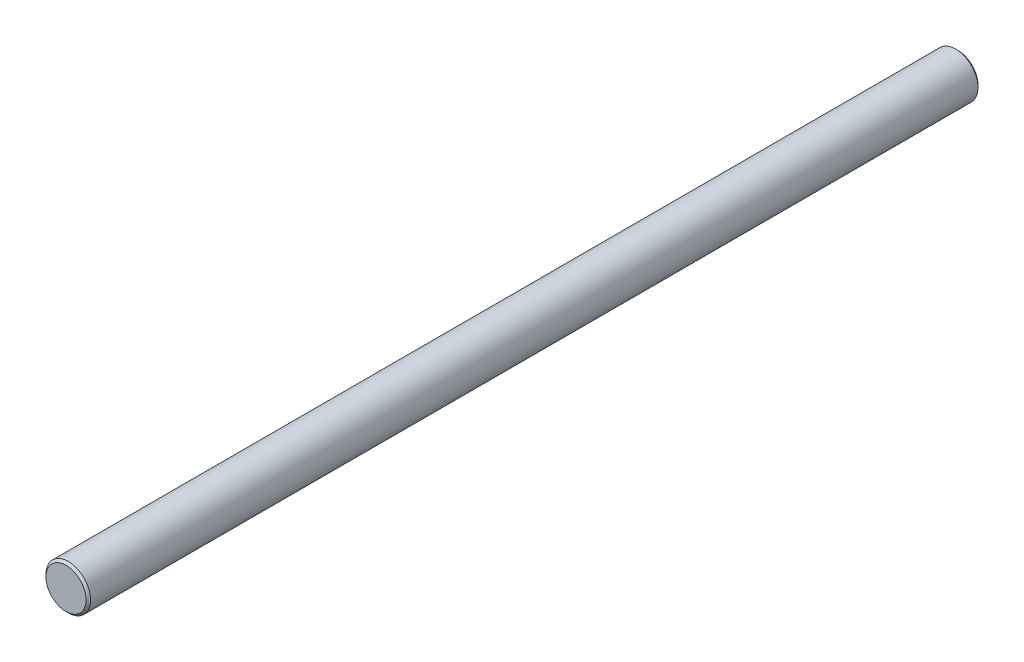
ISO-10303-21;
HEADER;
FILE_DESCRIPTION(('STEP AP214'),'2;1');
FILE_NAME('part.step','',(''),(''),'','','');
FILE_SCHEMA(('AUTOMOTIVE_DESIGN { 1 0 10303 214 1 1 1 1 }'));
ENDSEC;
DATA;
#1=APPLICATION_CONTEXT('core data for automotive mechanical design processes');
#2=APPLICATION_PROTOCOL_DEFINITION('international standard','automotive_design',2000,#1);
#3=PRODUCT_CONTEXT('',#1,'mechanical');
#4=PRODUCT('Part','Part','',(#3));
#5=PRODUCT_RELATED_PRODUCT_CATEGORY('part','',(#4));
#6=PRODUCT_DEFINITION_FORMATION('','',#4);
#7=PRODUCT_DEFINITION_CONTEXT('part definition',#1,'design');
#8=PRODUCT_DEFINITION('design','',#6,#7);
#9=PRODUCT_DEFINITION_SHAPE('','',#8);
#10=(LENGTH_UNIT() NAMED_UNIT(*) SI_UNIT(.MILLI.,.METRE.));
#11=(NAMED_UNIT(*) PLANE_ANGLE_UNIT() SI_UNIT($,.RADIAN.));
#12=(NAMED_UNIT(*) SI_UNIT($,.STERADIAN.) SOLID_ANGLE_UNIT());
#13=UNCERTAINTY_MEASURE_WITH_UNIT(LENGTH_MEASURE(1.E-05),#10,'distance_accuracy_value','');
#14=(GEOMETRIC_REPRESENTATION_CONTEXT(3) GLOBAL_UNCERTAINTY_ASSIGNED_CONTEXT((#13)) GLOBAL_UNIT_ASSIGNED_CONTEXT((#10,
#11,#12)) REPRESENTATION_CONTEXT('',''));
#15=CARTESIAN_POINT('',(0.,0.,0.));
#16=DIRECTION('',(0.,0.,1.));
#17=DIRECTION('',(1.,0.,0.));
#18=AXIS2_PLACEMENT_3D('',#15,#16,#17);
#19=CARTESIAN_POINT('',(0.,0.,400.));
#20=DIRECTION('',(0.,0.,-1.));
#21=DIRECTION('',(-1.,0.,0.));
#22=AXIS2_PLACEMENT_3D('',#19,#20,#21);
#23=CYLINDRICAL_SURFACE('',#22,10.);
#24=CARTESIAN_POINT('',(0.,-10.,318.));
#25=CARTESIAN_POINT('',(0.164577225506598,-9.99999858501101,317.99999800503));
#26=CARTESIAN_POINT('',(0.329174636703055,-9.99589831387907,317.986412272752));
#27=CARTESIAN_POINT('',(0.653576250609757,-9.97994211187382,317.932557291556));
#28=CARTESIAN_POINT('',(0.813379008822835,-9.96808386779384,317.892280083953));
#29=CARTESIAN_POINT('',(1.12346541550904,-9.93791105003673,317.786507966179));
#30=CARTESIAN_POINT('',(1.27376272879073,-9.91960600500851,317.721050260762));
#31=CARTESIAN_POINT('',(1.56124836210626,-9.87844218475291,317.566927813888));
#32=CARTESIAN_POINT('',(1.69843493493934,-9.85558280384133,317.478259985209));
#33=CARTESIAN_POINT('',(1.95974359436748,-9.80701474385548,317.277551985055));
#34=CARTESIAN_POINT('',(2.08343614248864,-9.78124767314073,317.164966748228));
#35=CARTESIAN_POINT('',(2.31049841846643,-9.73011668420885,316.92078154018));
#36=CARTESIAN_POINT('',(2.4138647265488,-9.70475283449003,316.78917837575));
#37=CARTESIAN_POINT('',(2.59960075447415,-9.65668227987544,316.507058493925));
#38=CARTESIAN_POINT('',(2.68144618044426,-9.6340481332775,316.356183078019));
#39=CARTESIAN_POINT('',(2.8184278954952,-9.59487240788062,316.042021491539));
#40=CARTESIAN_POINT('',(2.87357059839946,-9.57832936626621,315.878738312144));
#41=CARTESIAN_POINT('',(2.95403267365303,-9.55381741676869,315.549219467739));
#42=CARTESIAN_POINT('',(2.98014392469354,-9.54562138649067,315.383194512272));
#43=CARTESIAN_POINT('',(3.00427461229344,-9.53805579499534,315.048933687567));
#44=CARTESIAN_POINT('',(3.00230085522157,-9.53868409521142,314.880698363882));
#45=CARTESIAN_POINT('',(2.97093954399624,-9.54849488135555,314.553232182783));
#46=CARTESIAN_POINT('',(2.94254410525371,-9.55736777198281,314.393895499276));
#47=CARTESIAN_POINT('',(2.86074840854114,-9.58216712457248,314.082360427453));
#48=CARTESIAN_POINT('',(2.80734568283284,-9.598094282647,313.930162745251));
#49=CARTESIAN_POINT('',(2.67632053307366,-9.63545466149945,313.634799300679));
#50=CARTESIAN_POINT('',(2.59837633869288,-9.65696032231903,313.49178583209));
#51=CARTESIAN_POINT('',(2.4207044517737,-9.70301974000128,313.22053595598));
#52=CARTESIAN_POINT('',(2.32097148005179,-9.72757423493982,313.092303141172));
#53=CARTESIAN_POINT('',(2.09762581531095,-9.77822022595874,312.848627618476));
#54=CARTESIAN_POINT('',(1.97318981493396,-9.80433308620995,312.733942671941));
#55=CARTESIAN_POINT('',(1.70652651862794,-9.85424488126517,312.526892031872));
#56=CARTESIAN_POINT('',(1.56429810372178,-9.8780436703682,312.434527743171));
#57=CARTESIAN_POINT('',(1.26471007668561,-9.92086320138941,312.274280155071));
#58=CARTESIAN_POINT('',(1.10725549949592,-9.93985087336628,312.2065649675));
#59=CARTESIAN_POINT('',(0.782490831207058,-9.97067043664444,312.098800819801));
#60=CARTESIAN_POINT('',(0.615183503179172,-9.98250432373999,312.058744142935));
#61=CARTESIAN_POINT('',(0.281904485336665,-9.99736729287077,312.008695644201));
#62=CARTESIAN_POINT('',(0.116100195202379,-10.0006970083558,311.997676828397));
#63=CARTESIAN_POINT('',(-0.214999211646757,-9.99905846483519,312.003138311424));
#64=CARTESIAN_POINT('',(-0.380294393381552,-9.99409131355514,312.019614939303));
#65=CARTESIAN_POINT('',(-0.701807210619389,-9.97661393974325,312.078769222223));
#66=CARTESIAN_POINT('',(-0.858145545228339,-9.96427659598829,312.120846775162));
#67=CARTESIAN_POINT('',(-1.16150927790904,-9.9334869568307,312.229286465556));
#68=CARTESIAN_POINT('',(-1.30853355405116,-9.91503392642188,312.295651522076));
#69=CARTESIAN_POINT('',(-1.5928743789221,-9.87339308702631,312.452506330962));
#70=CARTESIAN_POINT('',(-1.72988765239934,-9.8501056165928,312.543518681896));
#71=CARTESIAN_POINT('',(-1.98704661596031,-9.80146937528705,312.746449508106));
#72=CARTESIAN_POINT('',(-2.10718806471188,-9.7761200886242,312.858373223775));
#73=CARTESIAN_POINT('',(-2.33171489102052,-9.72506343738007,313.104774616739));
#74=CARTESIAN_POINT('',(-2.43536962463002,-9.69937650065513,313.239923751544));
#75=CARTESIAN_POINT('',(-2.61857990144313,-9.65153030477949,313.526255878027));
#76=CARTESIAN_POINT('',(-2.69813607658964,-9.62937095313121,313.677438449116));
#77=CARTESIAN_POINT('',(-2.83034694254314,-9.5913437922631,313.99106498251));
#78=CARTESIAN_POINT('',(-2.8831269387402,-9.57544675673501,314.153452373076));
#79=CARTESIAN_POINT('',(-2.96043461630306,-9.55183188739737,314.48537593786));
#80=CARTESIAN_POINT('',(-2.98497197957849,-9.54411125069387,314.654909641566));
#81=CARTESIAN_POINT('',(-3.0044396896993,-9.53799944941558,314.988723036777));
#82=CARTESIAN_POINT('',(-3.00056110615886,-9.53923294700395,315.152927302099));
#83=CARTESIAN_POINT('',(-2.9661501088861,-9.54998802392189,315.478228206801));
#84=CARTESIAN_POINT('',(-2.93561876249407,-9.55950927135902,315.639324970361));
#85=CARTESIAN_POINT('',(-2.84953777608684,-9.58551527389243,315.951890798263));
#86=CARTESIAN_POINT('',(-2.79430351014246,-9.60191209104934,316.103454574717));
#87=CARTESIAN_POINT('',(-2.66063014242145,-9.63980557805266,316.395284877641));
#88=CARTESIAN_POINT('',(-2.5821865992572,-9.66130322385081,316.535549235283));
#89=CARTESIAN_POINT('',(-2.40097527610173,-9.70795352855339,316.806326233053));
#90=CARTESIAN_POINT('',(-2.29742552185994,-9.73321080328581,316.93629752252));
#91=CARTESIAN_POINT('',(-2.07034869259553,-9.78402640899067,317.177404996616));
#92=CARTESIAN_POINT('',(-1.94681643426897,-9.80958481647543,317.288536278936));
#93=CARTESIAN_POINT('',(-1.67893152436651,-9.85901873141573,317.49204682459));
#94=CARTESIAN_POINT('',(-1.5340757715812,-9.88282319531422,317.583782893711));
#95=CARTESIAN_POINT('',(-1.23028274796704,-9.92521360911553,317.741470339808));
#96=CARTESIAN_POINT('',(-1.0713521059979,-9.94380199862114,317.807433776549));
#97=CARTESIAN_POINT('',(-0.761515425310559,-9.97204349938619,317.905790551306));
#98=CARTESIAN_POINT('',(-0.611573923908462,-9.9824405476214,317.941023345766));
#99=CARTESIAN_POINT('',(-0.307760390461554,-9.9964188898898,317.988127050483));
#100=CARTESIAN_POINT('',(-0.153889019716276,-10.0000013230948,318.00000186541));
#101=CARTESIAN_POINT('',(0.,-10.,318.));
#102=B_SPLINE_CURVE_WITH_KNOTS('',3,(#24,#25,#26,#27,#28,#29,#30,#31,#32,#33,#34,#35,#36,#37,
#38,#39,#40,#41,#42,#43,#44,#45,#46,#47,#48,#49,#50,#51,#52,#53,#54,#55,#56,#57,#58,#59,#60,#61,
#62,#63,#64,#65,#66,#67,#68,#69,#70,#71,#72,#73,#74,#75,#76,#77,#78,#79,#80,#81,#82,#83,#84,#85,
#86,#87,#88,#89,#90,#91,#92,#93,#94,#95,#96,#97,#98,#99,#100,#101),.UNSPECIFIED.,.T.,.F.,(4,2,2,
2,2,2,2,2,2,2,2,2,2,2,2,2,2,2,2,2,2,2,2,2,2,2,2,2,2,2,2,2,2,2,2,2,2,2,4),(0.,0.493166407225214,
0.986479929691996,1.47906735260173,1.97172032882538,2.47711205896378,2.98258874577263,
3.49942962008214,4.01614629086449,4.51839378713192,5.02051956638177,5.50452033395344,
5.98856887315995,6.47924852894232,6.97004720317106,7.48134208096331,7.9926691306214,
8.50742093763375,9.02202907057615,9.51817618877089,10.0142570710065,10.4991349336465,
10.9840710918746,11.4802261140582,11.9765056400038,12.4908080064563,13.0050968850536,
13.516956299025,14.0286401892057,14.5190031093854,15.0093463933232,15.4936008081456,
15.9779479511534,16.4799385136898,16.9820594980412,17.4988599232246,18.0154182319959,
18.4766338387004,18.9377723390687),.UNSPECIFIED.);
#103=CARTESIAN_POINT('',(0.,-10.,318.));
#104=VERTEX_POINT('',#103);
#105=EDGE_CURVE('E10',#104,#104,#102,.T.);
#106=ORIENTED_EDGE('',*,*,#105,.T.);
#107=EDGE_LOOP('',(#106));
#108=FACE_BOUND('',#107,.T.);
#109=CARTESIAN_POINT('',(0.,-10.,168.));
#110=CARTESIAN_POINT('',(0.164577225506602,-9.99999858501101,167.99999800503));
#111=CARTESIAN_POINT('',(0.329174636703061,-9.99589831387907,167.986412272752));
#112=CARTESIAN_POINT('',(0.653576250609764,-9.97994211187382,167.932557291556));
#113=CARTESIAN_POINT('',(0.813379008822841,-9.96808386779384,167.892280083953));
#114=CARTESIAN_POINT('',(1.12346541550906,-9.93791105003673,167.786507966179));
#115=CARTESIAN_POINT('',(1.27376272879075,-9.91960600500851,167.721050260762));
#116=CARTESIAN_POINT('',(1.56124836210627,-9.8784421847529,167.566927813888));
#117=CARTESIAN_POINT('',(1.69843493493935,-9.85558280384133,167.478259985209));
#118=CARTESIAN_POINT('',(1.9597435943675,-9.80701474385548,167.277551985055));
#119=CARTESIAN_POINT('',(2.08343614248868,-9.78124767314073,167.164966748228));
#120=CARTESIAN_POINT('',(2.31049841846648,-9.73011668420884,166.92078154018));
#121=CARTESIAN_POINT('',(2.41386472654882,-9.70475283449002,166.78917837575));
#122=CARTESIAN_POINT('',(2.59960075447416,-9.65668227987544,166.507058493925));
#123=CARTESIAN_POINT('',(2.68144618044426,-9.63404813327749,166.356183078018));
#124=CARTESIAN_POINT('',(2.8184278954952,-9.59487240788062,166.042021491539));
#125=CARTESIAN_POINT('',(2.87357059839946,-9.57832936626621,165.878738312144));
#126=CARTESIAN_POINT('',(2.95403267365304,-9.55381741676868,165.549219467739));
#127=CARTESIAN_POINT('',(2.98014392469355,-9.54562138649066,165.383194512272));
#128=CARTESIAN_POINT('',(3.00427461229344,-9.53805579499534,165.048933687566));
#129=CARTESIAN_POINT('',(3.00230085522157,-9.53868409521142,164.880698363882));
#130=CARTESIAN_POINT('',(2.97093954399624,-9.54849488135556,164.553232182783));
#131=CARTESIAN_POINT('',(2.94254410525371,-9.55736777198281,164.393895499276));
#132=CARTESIAN_POINT('',(2.86074840854112,-9.58216712457248,164.082360427453));
#133=CARTESIAN_POINT('',(2.80734568283282,-9.59809428264701,163.930162745251));
#134=CARTESIAN_POINT('',(2.67632053307364,-9.63545466149946,163.634799300679));
#135=CARTESIAN_POINT('',(2.59837633869285,-9.65696032231904,163.491785832089));
#136=CARTESIAN_POINT('',(2.42070445177366,-9.70301974000129,163.22053595598));
#137=CARTESIAN_POINT('',(2.32097148005175,-9.72757423493982,163.092303141172));
#138=CARTESIAN_POINT('',(2.09762581531091,-9.77822022595875,162.848627618476));
#139=CARTESIAN_POINT('',(1.97318981493393,-9.80433308620996,162.733942671941));
#140=CARTESIAN_POINT('',(1.70652651862793,-9.85424488126517,162.526892031871));
#141=CARTESIAN_POINT('',(1.56429810372178,-9.8780436703682,162.434527743171));
#142=CARTESIAN_POINT('',(1.26471007668562,-9.92086320138941,162.27428015507));
#143=CARTESIAN_POINT('',(1.10725549949591,-9.93985087336628,162.2065649675));
#144=CARTESIAN_POINT('',(0.782490831207041,-9.97067043664444,162.098800819801));
#145=CARTESIAN_POINT('',(0.615183503179165,-9.98250432373999,162.058744142935));
#146=CARTESIAN_POINT('',(0.281904485336664,-9.99736729287077,162.008695644201));
#147=CARTESIAN_POINT('',(0.116100195202374,-10.0006970083558,161.997676828397));
#148=CARTESIAN_POINT('',(-0.214999211646766,-9.99905846483519,162.003138311424));
#149=CARTESIAN_POINT('',(-0.380294393381561,-9.99409131355514,162.019614939303));
#150=CARTESIAN_POINT('',(-0.701807210619393,-9.97661393974325,162.078769222223));
#151=CARTESIAN_POINT('',(-0.858145545228338,-9.96427659598829,162.120846775162));
#152=CARTESIAN_POINT('',(-1.16150927790904,-9.9334869568307,162.229286465556));
#153=CARTESIAN_POINT('',(-1.30853355405117,-9.91503392642188,162.295651522076));
#154=CARTESIAN_POINT('',(-1.5928743789221,-9.87339308702631,162.452506330962));
#155=CARTESIAN_POINT('',(-1.72988765239933,-9.8501056165928,162.543518681896));
#156=CARTESIAN_POINT('',(-1.98704661596029,-9.80146937528705,162.746449508106));
#157=CARTESIAN_POINT('',(-2.10718806471187,-9.7761200886242,162.858373223775));
#158=CARTESIAN_POINT('',(-2.33171489102052,-9.72506343738007,163.104774616739));
#159=CARTESIAN_POINT('',(-2.43536962463001,-9.69937650065513,163.239923751544));
#160=CARTESIAN_POINT('',(-2.61857990144313,-9.65153030477949,163.526255878027));
#161=CARTESIAN_POINT('',(-2.69813607658965,-9.62937095313121,163.677438449116));
#162=CARTESIAN_POINT('',(-2.83034694254317,-9.5913437922631,163.99106498251));
#163=CARTESIAN_POINT('',(-2.88312693874022,-9.575446756735,164.153452373076));
#164=CARTESIAN_POINT('',(-2.96043461630306,-9.55183188739737,164.48537593786));
#165=CARTESIAN_POINT('',(-2.98497197957849,-9.54411125069387,164.654909641566));
#166=CARTESIAN_POINT('',(-3.0044396896993,-9.53799944941558,164.988723036777));
#167=CARTESIAN_POINT('',(-3.00056110615887,-9.53923294700394,165.152927302099));
#168=CARTESIAN_POINT('',(-2.9661501088861,-9.54998802392188,165.478228206801));
#169=CARTESIAN_POINT('',(-2.93561876249407,-9.55950927135902,165.639324970361));
#170=CARTESIAN_POINT('',(-2.84953777608686,-9.58551527389243,165.951890798263));
#171=CARTESIAN_POINT('',(-2.79430351014248,-9.60191209104934,166.103454574717));
#172=CARTESIAN_POINT('',(-2.66063014242148,-9.63980557805265,166.395284877641));
#173=CARTESIAN_POINT('',(-2.58218659925723,-9.6613032238508,166.535549235283));
#174=CARTESIAN_POINT('',(-2.40097527610176,-9.70795352855338,166.806326233052));
#175=CARTESIAN_POINT('',(-2.29742552185997,-9.7332108032858,166.93629752252));
#176=CARTESIAN_POINT('',(-2.07034869259556,-9.78402640899066,167.177404996616));
#177=CARTESIAN_POINT('',(-1.94681643426899,-9.80958481647543,167.288536278936));
#178=CARTESIAN_POINT('',(-1.67893152436653,-9.85901873141573,167.49204682459));
#179=CARTESIAN_POINT('',(-1.53407577158123,-9.88282319531421,167.583782893711));
#180=CARTESIAN_POINT('',(-1.23028274796705,-9.92521360911553,167.741470339808));
#181=CARTESIAN_POINT('',(-1.0713521059979,-9.94380199862114,167.807433776549));
#182=CARTESIAN_POINT('',(-0.76151542531055,-9.97204349938619,167.905790551305));
#183=CARTESIAN_POINT('',(-0.611573923908459,-9.9824405476214,167.941023345766));
#184=CARTESIAN_POINT('',(-0.307760390461554,-9.9964188898898,167.988127050483));
#185=CARTESIAN_POINT('',(-0.153889019716276,-10.0000013230948,168.00000186541));
#186=CARTESIAN_POINT('',(0.,-10.,168.));
#187=B_SPLINE_CURVE_WITH_KNOTS('',3,(#109,#110,#111,#112,#113,#114,#115,#116,#117,#118,#119,
#120,#121,#122,#123,#124,#125,#126,#127,#128,#129,#130,#131,#132,#133,#134,#135,#136,#137,#138,
#139,#140,#141,#142,#143,#144,#145,#146,#147,#148,#149,#150,#151,#152,#153,#154,#155,#156,#157,
#158,#159,#160,#161,#162,#163,#164,#165,#166,#167,#168,#169,#170,#171,#172,#173,#174,#175,#176,
#177,#178,#179,#180,#181,#182,#183,#184,#185,#186),.UNSPECIFIED.,.T.,.F.,(4,2,2,2,2,2,2,2,2,2,2,
2,2,2,2,2,2,2,2,2,2,2,2,2,2,2,2,2,2,2,2,2,2,2,2,2,2,2,4),(0.,0.493166407225222,
0.986479929692003,1.47906735260175,1.97172032882541,2.47711205896384,2.98258874577266,
3.49942962008217,4.01614629086446,4.51839378713201,5.0205195663818,5.5045203339535,
5.98856887316001,6.47924852894241,6.97004720317114,7.48134208096334,7.99266913062142,
8.50742093763378,9.02202907057616,9.51817618877091,10.0142570710065,10.4991349336465,
10.9840710918746,11.4802261140582,11.9765056400038,12.4908080064564,13.0050968850536,
13.5169562990251,14.0286401892057,14.5190031093854,15.0093463933232,15.4936008081456,
15.9779479511533,16.4799385136898,16.9820594980412,17.4988599232246,18.0154182319959,
18.4766338387004,18.9377723390687),.UNSPECIFIED.);
#188=CARTESIAN_POINT('',(0.,-10.,168.));
#189=VERTEX_POINT('',#188);
#190=EDGE_CURVE('E46',#189,#189,#187,.T.);
#191=ORIENTED_EDGE('',*,*,#190,.T.);
#192=EDGE_LOOP('',(#191));
#193=FACE_BOUND('',#192,.T.);
#194=CARTESIAN_POINT('',(0.,-10.,18.));
#195=CARTESIAN_POINT('',(0.164577225506602,-9.99999858501101,17.9999980050302));
#196=CARTESIAN_POINT('',(0.329174636703061,-9.99589831387907,17.9864122727521));
#197=CARTESIAN_POINT('',(0.653576250609763,-9.97994211187382,17.9325572915558));
#198=CARTESIAN_POINT('',(0.813379008822841,-9.96808386779384,17.8922800839533));
#199=CARTESIAN_POINT('',(1.12346541550905,-9.93791105003673,17.7865079661795));
#200=CARTESIAN_POINT('',(1.27376272879075,-9.91960600500851,17.7210502607621));
#201=CARTESIAN_POINT('',(1.56124836210626,-9.87844218475291,17.5669278138883));
#202=CARTESIAN_POINT('',(1.69843493493934,-9.85558280384133,17.4782599852092));
#203=CARTESIAN_POINT('',(1.95974359436749,-9.80701474385548,17.2775519850547));
#204=CARTESIAN_POINT('',(2.08343614248868,-9.78124767314073,17.1649667482282));
#205=CARTESIAN_POINT('',(2.31049841846647,-9.73011668420884,16.9207815401796));
#206=CARTESIAN_POINT('',(2.41386472654882,-9.70475283449003,16.7891783757501));
#207=CARTESIAN_POINT('',(2.59960075447415,-9.65668227987544,16.5070584939248));
#208=CARTESIAN_POINT('',(2.68144618044427,-9.63404813327749,16.3561830780185));
#209=CARTESIAN_POINT('',(2.81842789549521,-9.59487240788062,16.0420214915394));
#210=CARTESIAN_POINT('',(2.87357059839947,-9.57832936626621,15.8787383121441));
#211=CARTESIAN_POINT('',(2.95403267365303,-9.55381741676868,15.5492194677391));
#212=CARTESIAN_POINT('',(2.98014392469355,-9.54562138649067,15.3831945122721));
#213=CARTESIAN_POINT('',(3.00427461229344,-9.53805579499534,15.0489336875665));
#214=CARTESIAN_POINT('',(3.00230085522157,-9.53868409521142,14.8806983638818));
#215=CARTESIAN_POINT('',(2.97093954399623,-9.54849488135555,14.553232182783));
#216=CARTESIAN_POINT('',(2.94254410525371,-9.55736777198281,14.3938954992755));
#217=CARTESIAN_POINT('',(2.86074840854112,-9.58216712457248,14.0823604274531));
#218=CARTESIAN_POINT('',(2.80734568283282,-9.59809428264701,13.9301627452513));
#219=CARTESIAN_POINT('',(2.67632053307363,-9.63545466149946,13.6347993006785));
#220=CARTESIAN_POINT('',(2.59837633869285,-9.65696032231904,13.4917858320895));
#221=CARTESIAN_POINT('',(2.42070445177367,-9.70301974000129,13.2205359559796));
#222=CARTESIAN_POINT('',(2.32097148005177,-9.72757423493982,13.0923031411724));
#223=CARTESIAN_POINT('',(2.09762581531093,-9.77822022595875,12.848627618476));
#224=CARTESIAN_POINT('',(1.97318981493395,-9.80433308620996,12.7339426719407));
#225=CARTESIAN_POINT('',(1.70652651862794,-9.85424488126517,12.5268920318715));
#226=CARTESIAN_POINT('',(1.56429810372178,-9.8780436703682,12.4345277431711));
#227=CARTESIAN_POINT('',(1.26471007668561,-9.92086320138941,12.2742801550705));
#228=CARTESIAN_POINT('',(1.1072554994959,-9.93985087336628,12.2065649675003));
#229=CARTESIAN_POINT('',(0.782490831207041,-9.97067043664444,12.0988008198007));
#230=CARTESIAN_POINT('',(0.615183503179165,-9.98250432373999,12.058744142935));
#231=CARTESIAN_POINT('',(0.281904485336666,-9.99736729287077,12.0086956442012));
#232=CARTESIAN_POINT('',(0.116100195202377,-10.0006970083558,11.9976768283968));
#233=CARTESIAN_POINT('',(-0.214999211646763,-9.99905846483519,12.0031383114242));
#234=CARTESIAN_POINT('',(-0.380294393381558,-9.99409131355514,12.0196149393029));
#235=CARTESIAN_POINT('',(-0.701807210619391,-9.97661393974325,12.078769222223));
#236=CARTESIAN_POINT('',(-0.858145545228337,-9.96427659598829,12.1208467751617));
#237=CARTESIAN_POINT('',(-1.16150927790904,-9.9334869568307,12.2292864655564));
#238=CARTESIAN_POINT('',(-1.30853355405117,-9.91503392642188,12.2956515220757));
#239=CARTESIAN_POINT('',(-1.5928743789221,-9.87339308702631,12.4525063309623));
#240=CARTESIAN_POINT('',(-1.72988765239933,-9.8501056165928,12.543518681896));
#241=CARTESIAN_POINT('',(-1.9870466159603,-9.80146937528705,12.7464495081056));
#242=CARTESIAN_POINT('',(-2.10718806471188,-9.7761200886242,12.8583732237753));
#243=CARTESIAN_POINT('',(-2.33171489102052,-9.72506343738007,13.1047746167387));
#244=CARTESIAN_POINT('',(-2.43536962463001,-9.69937650065513,13.2399237515436));
#245=CARTESIAN_POINT('',(-2.61857990144312,-9.65153030477949,13.5262558780269));
#246=CARTESIAN_POINT('',(-2.69813607658965,-9.62937095313121,13.6774384491158));
#247=CARTESIAN_POINT('',(-2.83034694254316,-9.5913437922631,13.99106498251));
#248=CARTESIAN_POINT('',(-2.88312693874021,-9.575446756735,14.1534523730757));
#249=CARTESIAN_POINT('',(-2.96043461630306,-9.55183188739737,14.4853759378605));
#250=CARTESIAN_POINT('',(-2.98497197957849,-9.54411125069387,14.6549096415661));
#251=CARTESIAN_POINT('',(-3.0044396896993,-9.53799944941558,14.9887230367768));
#252=CARTESIAN_POINT('',(-3.00056110615887,-9.53923294700395,15.1529273020988));
#253=CARTESIAN_POINT('',(-2.9661501088861,-9.54998802392189,15.4782282068012));
#254=CARTESIAN_POINT('',(-2.93561876249407,-9.55950927135902,15.639324970361));
#255=CARTESIAN_POINT('',(-2.84953777608686,-9.58551527389243,15.9518907982633));
#256=CARTESIAN_POINT('',(-2.79430351014248,-9.60191209104934,16.1034545747174));
#257=CARTESIAN_POINT('',(-2.66063014242147,-9.63980557805265,16.3952848776414));
#258=CARTESIAN_POINT('',(-2.58218659925722,-9.6613032238508,16.5355492352831));
#259=CARTESIAN_POINT('',(-2.40097527610175,-9.70795352855338,16.8063262330525));
#260=CARTESIAN_POINT('',(-2.29742552185996,-9.7332108032858,16.9362975225204));
#261=CARTESIAN_POINT('',(-2.07034869259555,-9.78402640899066,17.1774049966162));
#262=CARTESIAN_POINT('',(-1.94681643426898,-9.80958481647543,17.2885362789356));
#263=CARTESIAN_POINT('',(-1.67893152436652,-9.85901873141573,17.4920468245899));
#264=CARTESIAN_POINT('',(-1.53407577158122,-9.88282319531421,17.5837828937109));
#265=CARTESIAN_POINT('',(-1.23028274796705,-9.92521360911553,17.7414703398081));
#266=CARTESIAN_POINT('',(-1.07135210599791,-9.94380199862114,17.807433776549));
#267=CARTESIAN_POINT('',(-0.761515425310564,-9.97204349938619,17.9057905513055));
#268=CARTESIAN_POINT('',(-0.611573923908468,-9.9824405476214,17.9410233457665));
#269=CARTESIAN_POINT('',(-0.307760390461557,-9.9964188898898,17.9881270504832));
#270=CARTESIAN_POINT('',(-0.153889019716277,-10.0000013230948,18.0000018654096));
#271=CARTESIAN_POINT('',(0.,-10.,18.));
#272=B_SPLINE_CURVE_WITH_KNOTS('',3,(#194,#195,#196,#197,#198,#199,#200,#201,#202,#203,#204,
#205,#206,#207,#208,#209,#210,#211,#212,#213,#214,#215,#216,#217,#218,#219,#220,#221,#222,#223,
#224,#225,#226,#227,#228,#229,#230,#231,#232,#233,#234,#235,#236,#237,#238,#239,#240,#241,#242,
#243,#244,#245,#246,#247,#248,#249,#250,#251,#252,#253,#254,#255,#256,#257,#258,#259,#260,#261,
#262,#263,#264,#265,#266,#267,#268,#269,#270,#271),.UNSPECIFIED.,.T.,.F.,(4,2,2,2,2,2,2,2,2,2,2,
2,2,2,2,2,2,2,2,2,2,2,2,2,2,2,2,2,2,2,2,2,2,2,2,2,2,2,4),(0.,0.493166407225221,
0.986479929691998,1.47906735260175,1.9717203288254,2.47711205896383,2.98258874577266,
3.49942962008218,4.01614629086447,4.51839378713198,5.02051956638179,5.50452033395352,
5.98856887316003,6.47924852894239,6.97004720317111,7.48134208096333,7.99266913062143,
8.50742093763377,9.02202907057615,9.5181761887709,10.0142570710065,10.4991349336465,
10.9840710918746,11.4802261140582,11.9765056400038,12.4908080064564,13.0050968850536,
13.516956299025,14.0286401892057,14.5190031093854,15.0093463933232,15.4936008081456,
15.9779479511533,16.4799385136898,16.9820594980412,17.4988599232246,18.0154182319959,
18.4766338387004,18.9377723390687),.UNSPECIFIED.);
#273=CARTESIAN_POINT('',(0.,-10.,18.));
#274=VERTEX_POINT('',#273);
#275=EDGE_CURVE('E50',#274,#274,#272,.T.);
#276=ORIENTED_EDGE('',*,*,#275,.T.);
#277=EDGE_LOOP('',(#276));
#278=FACE_BOUND('',#277,.T.);
#279=CARTESIAN_POINT('',(0.,0.,399.));
#280=DIRECTION('',(0.,0.,1.));
#281=DIRECTION('',(1.,0.,0.));
#282=AXIS2_PLACEMENT_3D('',#279,#280,#281);
#283=CIRCLE('',#282,10.);
#284=CARTESIAN_POINT('',(10.,0.,399.));
#285=VERTEX_POINT('',#284);
#286=EDGE_CURVE('E101',#285,#285,#283,.F.);
#287=ORIENTED_EDGE('',*,*,#286,.T.);
#288=EDGE_LOOP('',(#287));
#289=FACE_BOUND('',#288,.T.);
#290=CARTESIAN_POINT('',(0.,0.,1.));
#291=DIRECTION('',(0.,0.,1.));
#292=DIRECTION('',(1.,0.,0.));
#293=AXIS2_PLACEMENT_3D('',#290,#291,#292);
#294=CIRCLE('',#293,10.);
#295=CARTESIAN_POINT('',(10.,0.,1.));
#296=VERTEX_POINT('',#295);
#297=EDGE_CURVE('E104',#296,#296,#294,.T.);
#298=ORIENTED_EDGE('',*,*,#297,.T.);
#299=EDGE_LOOP('',(#298));
#300=FACE_BOUND('',#299,.T.);
#301=ADVANCED_FACE('F35',(#108,#193,#278,#289,#300),#23,.T.);
#302=CARTESIAN_POINT('',(0.,0.,400.));
#303=DIRECTION('',(0.,0.,1.));
#304=DIRECTION('',(1.,0.,0.));
#305=AXIS2_PLACEMENT_3D('',#302,#303,#304);
#306=PLANE('',#305);
#307=CARTESIAN_POINT('',(0.,0.,400.));
#308=DIRECTION('',(0.,0.,1.));
#309=DIRECTION('',(1.,0.,0.));
#310=AXIS2_PLACEMENT_3D('',#307,#308,#309);
#311=CIRCLE('',#310,9.00000000000006);
#312=CARTESIAN_POINT('',(9.00000000000006,0.,400.));
#313=VERTEX_POINT('',#312);
#314=EDGE_CURVE('E106',#313,#313,#311,.T.);
#315=ORIENTED_EDGE('',*,*,#314,.T.);
#316=EDGE_LOOP('',(#315));
#317=FACE_BOUND('',#316,.T.);
#318=ADVANCED_FACE('F80',(#317),#306,.T.);
#319=CARTESIAN_POINT('',(0.,0.,0.));
#320=DIRECTION('',(0.,0.,1.));
#321=DIRECTION('',(1.,0.,0.));
#322=AXIS2_PLACEMENT_3D('',#319,#320,#321);
#323=PLANE('',#322);
#324=CARTESIAN_POINT('',(0.,0.,0.));
#325=DIRECTION('',(0.,0.,1.));
#326=DIRECTION('',(1.,0.,0.));
#327=AXIS2_PLACEMENT_3D('',#324,#325,#326);
#328=CIRCLE('',#327,9.00000000000001);
#329=CARTESIAN_POINT('',(9.00000000000001,0.,0.));
#330=VERTEX_POINT('',#329);
#331=EDGE_CURVE('E54',#330,#330,#328,.F.);
#332=ORIENTED_EDGE('',*,*,#331,.T.);
#333=EDGE_LOOP('',(#332));
#334=FACE_BOUND('',#333,.T.);
#335=ADVANCED_FACE('F82',(#334),#323,.F.);
#336=CARTESIAN_POINT('',(0.,0.,400.));
#337=DIRECTION('',(0.,0.,-1.));
#338=DIRECTION('',(-1.,0.,0.));
#339=AXIS2_PLACEMENT_3D('',#336,#337,#338);
#340=CONICAL_SURFACE('',#339,9.00000000000006,0.785398163397444);
#341=ORIENTED_EDGE('',*,*,#286,.F.);
#342=EDGE_LOOP('',(#341));
#343=FACE_BOUND('',#342,.T.);
#344=ORIENTED_EDGE('',*,*,#314,.F.);
#345=EDGE_LOOP('',(#344));
#346=FACE_BOUND('',#345,.T.);
#347=ADVANCED_FACE('F85',(#343,#346),#340,.T.);
#348=CARTESIAN_POINT('',(0.,0.,1.));
#349=DIRECTION('',(0.,0.,1.));
#350=DIRECTION('',(1.,0.,0.));
#351=AXIS2_PLACEMENT_3D('',#348,#349,#350);
#352=CONICAL_SURFACE('',#351,10.,0.785398163397444);
#353=ORIENTED_EDGE('',*,*,#331,.F.);
#354=EDGE_LOOP('',(#353));
#355=FACE_BOUND('',#354,.T.);
#356=ORIENTED_EDGE('',*,*,#297,.F.);
#357=EDGE_LOOP('',(#356));
#358=FACE_BOUND('',#357,.T.);
#359=ADVANCED_FACE('F37',(#355,#358),#352,.T.);
#360=CARTESIAN_POINT('',(0.,-10.,15.));
#361=DIRECTION('',(0.,1.,0.));
#362=DIRECTION('',(0.,0.,1.));
#363=AXIS2_PLACEMENT_3D('',#360,#361,#362);
#364=CYLINDRICAL_SURFACE('',#363,3.);
#365=CARTESIAN_POINT('',(0.,0.,15.));
#366=DIRECTION('',(0.,1.,0.));
#367=DIRECTION('',(0.,0.,1.));
#368=AXIS2_PLACEMENT_3D('',#365,#366,#367);
#369=CIRCLE('',#368,3.);
#370=CARTESIAN_POINT('',(0.,0.,18.));
#371=VERTEX_POINT('',#370);
#372=EDGE_CURVE('E110',#371,#371,#369,.T.);
#373=ORIENTED_EDGE('',*,*,#372,.T.);
#374=EDGE_LOOP('',(#373));
#375=FACE_BOUND('',#374,.T.);
#376=ORIENTED_EDGE('',*,*,#275,.F.);
#377=EDGE_LOOP('',(#376));
#378=FACE_BOUND('',#377,.T.);
#379=ADVANCED_FACE('F74',(#375,#378),#364,.F.);
#380=CARTESIAN_POINT('',(0.,0.,15.));
#381=DIRECTION('',(0.,1.,0.));
#382=DIRECTION('',(0.,0.,1.));
#383=AXIS2_PLACEMENT_3D('',#380,#381,#382);
#384=PLANE('',#383);
#385=ORIENTED_EDGE('',*,*,#372,.F.);
#386=EDGE_LOOP('',(#385));
#387=FACE_BOUND('',#386,.T.);
#388=ADVANCED_FACE('F71',(#387),#384,.F.);
#389=CARTESIAN_POINT('',(0.,-10.,165.));
#390=DIRECTION('',(0.,1.,0.));
#391=DIRECTION('',(0.,0.,1.));
#392=AXIS2_PLACEMENT_3D('',#389,#390,#391);
#393=CYLINDRICAL_SURFACE('',#392,3.);
#394=CARTESIAN_POINT('',(0.,0.,165.));
#395=DIRECTION('',(0.,1.,0.));
#396=DIRECTION('',(0.,0.,1.));
#397=AXIS2_PLACEMENT_3D('',#394,#395,#396);
#398=CIRCLE('',#397,3.);
#399=CARTESIAN_POINT('',(0.,0.,168.));
#400=VERTEX_POINT('',#399);
#401=EDGE_CURVE('E215',#400,#400,#398,.T.);
#402=ORIENTED_EDGE('',*,*,#401,.T.);
#403=EDGE_LOOP('',(#402));
#404=FACE_BOUND('',#403,.T.);
#405=ORIENTED_EDGE('',*,*,#190,.F.);
#406=EDGE_LOOP('',(#405));
#407=FACE_BOUND('',#406,.T.);
#408=ADVANCED_FACE('F65',(#404,#407),#393,.F.);
#409=CARTESIAN_POINT('',(0.,0.,165.));
#410=DIRECTION('',(0.,1.,0.));
#411=DIRECTION('',(0.,0.,1.));
#412=AXIS2_PLACEMENT_3D('',#409,#410,#411);
#413=PLANE('',#412);
#414=ORIENTED_EDGE('',*,*,#401,.F.);
#415=EDGE_LOOP('',(#414));
#416=FACE_BOUND('',#415,.T.);
#417=ADVANCED_FACE('F70',(#416),#413,.F.);
#418=CARTESIAN_POINT('',(0.,-10.,315.));
#419=DIRECTION('',(0.,1.,0.));
#420=DIRECTION('',(0.,0.,1.));
#421=AXIS2_PLACEMENT_3D('',#418,#419,#420);
#422=CYLINDRICAL_SURFACE('',#421,3.);
#423=CARTESIAN_POINT('',(0.,0.,315.));
#424=DIRECTION('',(0.,1.,0.));
#425=DIRECTION('',(0.,0.,1.));
#426=AXIS2_PLACEMENT_3D('',#423,#424,#425);
#427=CIRCLE('',#426,3.);
#428=CARTESIAN_POINT('',(0.,0.,318.));
#429=VERTEX_POINT('',#428);
#430=EDGE_CURVE('E214',#429,#429,#427,.T.);
#431=ORIENTED_EDGE('',*,*,#430,.T.);
#432=EDGE_LOOP('',(#431));
#433=FACE_BOUND('',#432,.T.);
#434=ORIENTED_EDGE('',*,*,#105,.F.);
#435=EDGE_LOOP('',(#434));
#436=FACE_BOUND('',#435,.T.);
#437=ADVANCED_FACE('F140',(#433,#436),#422,.F.);
#438=CARTESIAN_POINT('',(0.,0.,315.));
#439=DIRECTION('',(0.,1.,0.));
#440=DIRECTION('',(0.,0.,1.));
#441=AXIS2_PLACEMENT_3D('',#438,#439,#440);
#442=PLANE('',#441);
#443=ORIENTED_EDGE('',*,*,#430,.F.);
#444=EDGE_LOOP('',(#443));
#445=FACE_BOUND('',#444,.T.);
#446=ADVANCED_FACE('F147',(#445),#442,.F.);
#447=CLOSED_SHELL('',(#301,#318,#335,#347,#359,#379,#388,#408,#417,#437,#446));
#448=MANIFOLD_SOLID_BREP('B2',#447);
#449=ADVANCED_BREP_SHAPE_REPRESENTATION('',(#18,#448),#14);
#450=SHAPE_DEFINITION_REPRESENTATION(#9,#449);
ENDSEC;
END-ISO-10303-21;
